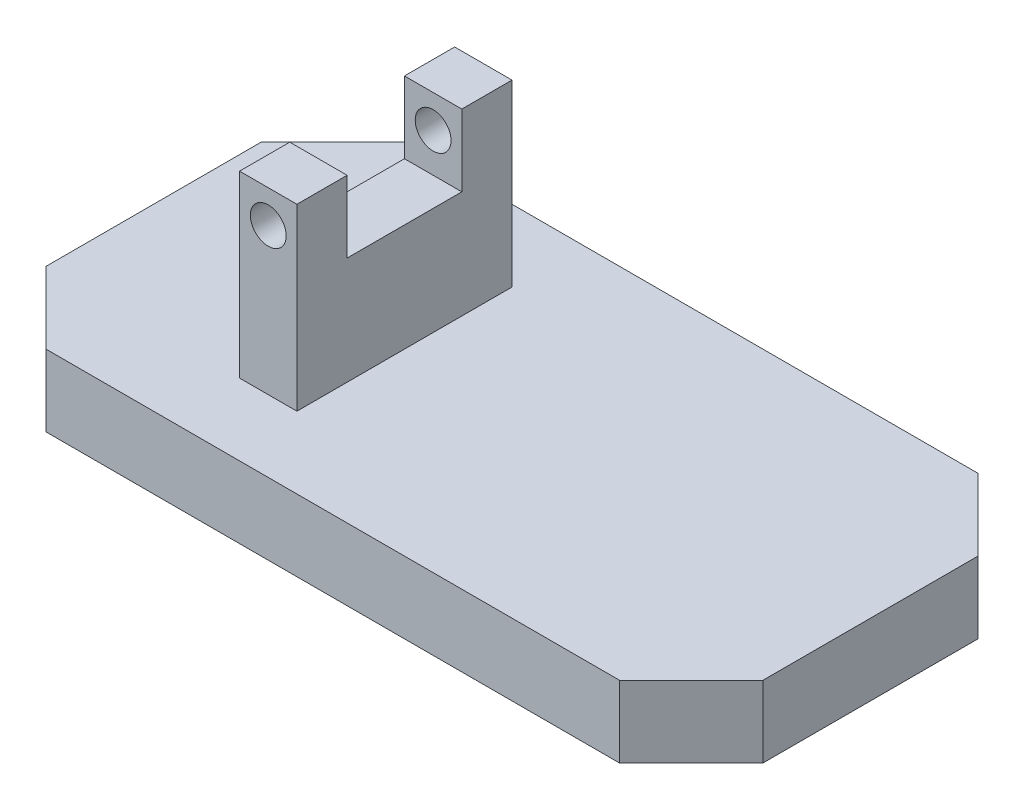
ISO-10303-21;
HEADER;
FILE_DESCRIPTION(('STEP AP214'),'2;1');
FILE_NAME('part.step','',(''),(''),'','','');
FILE_SCHEMA(('AUTOMOTIVE_DESIGN { 1 0 10303 214 1 1 1 1 }'));
ENDSEC;
DATA;
#1=APPLICATION_CONTEXT('core data for automotive mechanical design processes');
#2=APPLICATION_PROTOCOL_DEFINITION('international standard','automotive_design',2000,#1);
#3=PRODUCT_CONTEXT('',#1,'mechanical');
#4=PRODUCT('Part','Part','',(#3));
#5=PRODUCT_RELATED_PRODUCT_CATEGORY('part','',(#4));
#6=PRODUCT_DEFINITION_FORMATION('','',#4);
#7=PRODUCT_DEFINITION_CONTEXT('part definition',#1,'design');
#8=PRODUCT_DEFINITION('design','',#6,#7);
#9=PRODUCT_DEFINITION_SHAPE('','',#8);
#10=(LENGTH_UNIT() NAMED_UNIT(*) SI_UNIT(.MILLI.,.METRE.));
#11=(NAMED_UNIT(*) PLANE_ANGLE_UNIT() SI_UNIT($,.RADIAN.));
#12=(NAMED_UNIT(*) SI_UNIT($,.STERADIAN.) SOLID_ANGLE_UNIT());
#13=UNCERTAINTY_MEASURE_WITH_UNIT(LENGTH_MEASURE(1.E-05),#10,'distance_accuracy_value','');
#14=(GEOMETRIC_REPRESENTATION_CONTEXT(3) GLOBAL_UNCERTAINTY_ASSIGNED_CONTEXT((#13)) GLOBAL_UNIT_ASSIGNED_CONTEXT((#10,
#11,#12)) REPRESENTATION_CONTEXT('',''));
#15=CARTESIAN_POINT('',(0.,0.,0.));
#16=DIRECTION('',(0.,0.,1.));
#17=DIRECTION('',(1.,0.,0.));
#18=AXIS2_PLACEMENT_3D('',#15,#16,#17);
#19=CARTESIAN_POINT('',(0.,35.,0.));
#20=DIRECTION('',(0.,1.,0.));
#21=DIRECTION('',(0.,0.,1.));
#22=AXIS2_PLACEMENT_3D('',#19,#20,#21);
#23=PLANE('',#22);
#24=DIRECTION('',(-1.,0.,0.));
#25=VECTOR('',#24,1.);
#26=CARTESIAN_POINT('',(0.,35.,-8.));
#27=LINE('',#26,#25);
#28=CARTESIAN_POINT('',(-15.,35.,-8.));
#29=VERTEX_POINT('',#28);
#30=CARTESIAN_POINT('',(-23.,35.,-8.));
#31=VERTEX_POINT('',#30);
#32=EDGE_CURVE('E55',#29,#31,#27,.T.);
#33=ORIENTED_EDGE('',*,*,#32,.F.);
#34=DIRECTION('',(0.,0.,-1.));
#35=VECTOR('',#34,1.);
#36=CARTESIAN_POINT('',(-15.,35.,-15.));
#37=LINE('',#36,#35);
#38=CARTESIAN_POINT('',(-15.,35.,-15.));
#39=VERTEX_POINT('',#38);
#40=EDGE_CURVE('E183',#29,#39,#37,.T.);
#41=ORIENTED_EDGE('',*,*,#40,.T.);
#42=DIRECTION('',(-1.,0.,0.));
#43=VECTOR('',#42,1.);
#44=CARTESIAN_POINT('',(-23.,35.,-15.));
#45=LINE('',#44,#43);
#46=CARTESIAN_POINT('',(-23.,35.,-15.));
#47=VERTEX_POINT('',#46);
#48=EDGE_CURVE('E182',#39,#47,#45,.T.);
#49=ORIENTED_EDGE('',*,*,#48,.T.);
#50=DIRECTION('',(0.,0.,1.));
#51=VECTOR('',#50,1.);
#52=CARTESIAN_POINT('',(-23.,35.,-15.));
#53=LINE('',#52,#51);
#54=EDGE_CURVE('E281',#47,#31,#53,.T.);
#55=ORIENTED_EDGE('',*,*,#54,.T.);
#56=EDGE_LOOP('',(#33,#41,#49,#55));
#57=FACE_BOUND('',#56,.T.);
#58=ADVANCED_FACE('F45',(#57),#23,.T.);
#59=CARTESIAN_POINT('',(0.,10.,0.));
#60=DIRECTION('',(0.,1.,0.));
#61=DIRECTION('',(0.,0.,1.));
#62=AXIS2_PLACEMENT_3D('',#59,#60,#61);
#63=PLANE('',#62);
#64=DIRECTION('',(-1.,0.,0.));
#65=VECTOR('',#64,1.);
#66=CARTESIAN_POINT('',(-50.,10.,-25.));
#67=LINE('',#66,#65);
#68=CARTESIAN_POINT('',(40.,10.,-25.));
#69=VERTEX_POINT('',#68);
#70=CARTESIAN_POINT('',(-40.,10.,-25.));
#71=VERTEX_POINT('',#70);
#72=EDGE_CURVE('E219',#69,#71,#67,.T.);
#73=ORIENTED_EDGE('',*,*,#72,.T.);
#74=DIRECTION('',(0.707106781186549,0.,-0.707106781186547));
#75=VECTOR('',#74,1.);
#76=CARTESIAN_POINT('',(-32.4999999999999,10.,-32.5));
#77=LINE('',#76,#75);
#78=CARTESIAN_POINT('',(-50.,10.,-15.));
#79=VERTEX_POINT('',#78);
#80=EDGE_CURVE('E256',#71,#79,#77,.F.);
#81=ORIENTED_EDGE('',*,*,#80,.T.);
#82=DIRECTION('',(0.,0.,1.));
#83=VECTOR('',#82,1.);
#84=CARTESIAN_POINT('',(-50.,10.,-25.));
#85=LINE('',#84,#83);
#86=CARTESIAN_POINT('',(-50.,10.,15.));
#87=VERTEX_POINT('',#86);
#88=EDGE_CURVE('E209',#79,#87,#85,.T.);
#89=ORIENTED_EDGE('',*,*,#88,.T.);
#90=DIRECTION('',(-0.707106781186546,0.,-0.707106781186549));
#91=VECTOR('',#90,1.);
#92=CARTESIAN_POINT('',(-32.5000000000001,10.,32.5));
#93=LINE('',#92,#91);
#94=CARTESIAN_POINT('',(-40.,10.,25.));
#95=VERTEX_POINT('',#94);
#96=EDGE_CURVE('E254',#87,#95,#93,.F.);
#97=ORIENTED_EDGE('',*,*,#96,.T.);
#98=DIRECTION('',(1.,0.,0.));
#99=VECTOR('',#98,1.);
#100=CARTESIAN_POINT('',(-50.,10.,25.));
#101=LINE('',#100,#99);
#102=CARTESIAN_POINT('',(39.9999999999999,10.,25.));
#103=VERTEX_POINT('',#102);
#104=EDGE_CURVE('E212',#95,#103,#101,.T.);
#105=ORIENTED_EDGE('',*,*,#104,.T.);
#106=DIRECTION('',(-0.707106781186549,0.,0.707106781186546));
#107=VECTOR('',#106,1.);
#108=CARTESIAN_POINT('',(32.4999999999999,10.,32.5));
#109=LINE('',#108,#107);
#110=CARTESIAN_POINT('',(50.,10.,15.));
#111=VERTEX_POINT('',#110);
#112=EDGE_CURVE('E250',#103,#111,#109,.F.);
#113=ORIENTED_EDGE('',*,*,#112,.T.);
#114=DIRECTION('',(0.,0.,-1.));
#115=VECTOR('',#114,1.);
#116=CARTESIAN_POINT('',(50.,10.,-25.));
#117=LINE('',#116,#115);
#118=CARTESIAN_POINT('',(50.,10.,-15.));
#119=VERTEX_POINT('',#118);
#120=EDGE_CURVE('E216',#111,#119,#117,.T.);
#121=ORIENTED_EDGE('',*,*,#120,.T.);
#122=DIRECTION('',(0.707106781186547,0.,0.707106781186549));
#123=VECTOR('',#122,1.);
#124=CARTESIAN_POINT('',(32.5,10.,-32.5));
#125=LINE('',#124,#123);
#126=EDGE_CURVE('E252',#119,#69,#125,.F.);
#127=ORIENTED_EDGE('',*,*,#126,.T.);
#128=EDGE_LOOP('',(#73,#81,#89,#97,#105,#113,#121,#127));
#129=FACE_BOUND('',#128,.T.);
#130=DIRECTION('',(1.,0.,0.));
#131=VECTOR('',#130,1.);
#132=CARTESIAN_POINT('',(-23.,10.,15.));
#133=LINE('',#132,#131);
#134=CARTESIAN_POINT('',(-23.,10.,15.));
#135=VERTEX_POINT('',#134);
#136=CARTESIAN_POINT('',(-15.,10.,15.));
#137=VERTEX_POINT('',#136);
#138=EDGE_CURVE('E193',#135,#137,#133,.T.);
#139=ORIENTED_EDGE('',*,*,#138,.F.);
#140=DIRECTION('',(0.,0.,1.));
#141=VECTOR('',#140,1.);
#142=CARTESIAN_POINT('',(-23.,10.,-15.));
#143=LINE('',#142,#141);
#144=CARTESIAN_POINT('',(-23.,10.,-15.));
#145=VERTEX_POINT('',#144);
#146=EDGE_CURVE('E190',#145,#135,#143,.T.);
#147=ORIENTED_EDGE('',*,*,#146,.F.);
#148=DIRECTION('',(-1.,0.,0.));
#149=VECTOR('',#148,1.);
#150=CARTESIAN_POINT('',(-23.,10.,-15.));
#151=LINE('',#150,#149);
#152=CARTESIAN_POINT('',(-15.,10.,-15.));
#153=VERTEX_POINT('',#152);
#154=EDGE_CURVE('E198',#153,#145,#151,.T.);
#155=ORIENTED_EDGE('',*,*,#154,.F.);
#156=DIRECTION('',(0.,0.,-1.));
#157=VECTOR('',#156,1.);
#158=CARTESIAN_POINT('',(-15.,10.,-15.));
#159=LINE('',#158,#157);
#160=EDGE_CURVE('E196',#137,#153,#159,.T.);
#161=ORIENTED_EDGE('',*,*,#160,.F.);
#162=EDGE_LOOP('',(#139,#147,#155,#161));
#163=FACE_BOUND('',#162,.T.);
#164=ADVANCED_FACE('F317',(#129,#163),#63,.T.);
#165=CARTESIAN_POINT('',(-50.,10.,-25.));
#166=DIRECTION('',(1.,0.,0.));
#167=DIRECTION('',(0.,0.,-1.));
#168=AXIS2_PLACEMENT_3D('',#165,#166,#167);
#169=PLANE('',#168);
#170=ORIENTED_EDGE('',*,*,#88,.F.);
#171=DIRECTION('',(0.,-1.,0.));
#172=VECTOR('',#171,1.);
#173=CARTESIAN_POINT('',(-50.,10.,-15.));
#174=LINE('',#173,#172);
#175=CARTESIAN_POINT('',(-50.,0.,-15.));
#176=VERTEX_POINT('',#175);
#177=EDGE_CURVE('E234',#79,#176,#174,.T.);
#178=ORIENTED_EDGE('',*,*,#177,.T.);
#179=DIRECTION('',(0.,0.,1.));
#180=VECTOR('',#179,1.);
#181=CARTESIAN_POINT('',(-50.,0.,-25.));
#182=LINE('',#181,#180);
#183=CARTESIAN_POINT('',(-50.,0.,15.));
#184=VERTEX_POINT('',#183);
#185=EDGE_CURVE('E208',#176,#184,#182,.T.);
#186=ORIENTED_EDGE('',*,*,#185,.T.);
#187=DIRECTION('',(0.,1.,0.));
#188=VECTOR('',#187,1.);
#189=CARTESIAN_POINT('',(-50.,10.,15.));
#190=LINE('',#189,#188);
#191=EDGE_CURVE('E222',#184,#87,#190,.T.);
#192=ORIENTED_EDGE('',*,*,#191,.T.);
#193=EDGE_LOOP('',(#170,#178,#186,#192));
#194=FACE_BOUND('',#193,.T.);
#195=ADVANCED_FACE('F323',(#194),#169,.F.);
#196=CARTESIAN_POINT('',(-50.,10.,25.));
#197=DIRECTION('',(0.,0.,-1.));
#198=DIRECTION('',(-1.,0.,0.));
#199=AXIS2_PLACEMENT_3D('',#196,#197,#198);
#200=PLANE('',#199);
#201=ORIENTED_EDGE('',*,*,#104,.F.);
#202=DIRECTION('',(0.,-1.,0.));
#203=VECTOR('',#202,1.);
#204=CARTESIAN_POINT('',(-40.,10.,25.));
#205=LINE('',#204,#203);
#206=CARTESIAN_POINT('',(-40.,0.,25.));
#207=VERTEX_POINT('',#206);
#208=EDGE_CURVE('E260',#95,#207,#205,.T.);
#209=ORIENTED_EDGE('',*,*,#208,.T.);
#210=DIRECTION('',(1.,0.,0.));
#211=VECTOR('',#210,1.);
#212=CARTESIAN_POINT('',(-50.,0.,25.));
#213=LINE('',#212,#211);
#214=CARTESIAN_POINT('',(39.9999999999999,0.,25.));
#215=VERTEX_POINT('',#214);
#216=EDGE_CURVE('E225',#207,#215,#213,.T.);
#217=ORIENTED_EDGE('',*,*,#216,.T.);
#218=DIRECTION('',(0.,1.,0.));
#219=VECTOR('',#218,1.);
#220=CARTESIAN_POINT('',(39.9999999999999,10.,25.));
#221=LINE('',#220,#219);
#222=EDGE_CURVE('E258',#215,#103,#221,.T.);
#223=ORIENTED_EDGE('',*,*,#222,.T.);
#224=EDGE_LOOP('',(#201,#209,#217,#223));
#225=FACE_BOUND('',#224,.T.);
#226=ADVANCED_FACE('F359',(#225),#200,.F.);
#227=CARTESIAN_POINT('',(50.,10.,-25.));
#228=DIRECTION('',(-1.,0.,0.));
#229=DIRECTION('',(0.,0.,1.));
#230=AXIS2_PLACEMENT_3D('',#227,#228,#229);
#231=PLANE('',#230);
#232=DIRECTION('',(0.,0.,-1.));
#233=VECTOR('',#232,1.);
#234=CARTESIAN_POINT('',(50.,0.,-25.));
#235=LINE('',#234,#233);
#236=CARTESIAN_POINT('',(50.,0.,15.));
#237=VERTEX_POINT('',#236);
#238=CARTESIAN_POINT('',(50.,0.,-15.));
#239=VERTEX_POINT('',#238);
#240=EDGE_CURVE('E228',#237,#239,#235,.T.);
#241=ORIENTED_EDGE('',*,*,#240,.T.);
#242=DIRECTION('',(0.,1.,0.));
#243=VECTOR('',#242,1.);
#244=CARTESIAN_POINT('',(50.,10.,-15.));
#245=LINE('',#244,#243);
#246=EDGE_CURVE('E166',#239,#119,#245,.T.);
#247=ORIENTED_EDGE('',*,*,#246,.T.);
#248=ORIENTED_EDGE('',*,*,#120,.F.);
#249=DIRECTION('',(0.,-1.,0.));
#250=VECTOR('',#249,1.);
#251=CARTESIAN_POINT('',(50.,10.,15.));
#252=LINE('',#251,#250);
#253=EDGE_CURVE('E263',#111,#237,#252,.T.);
#254=ORIENTED_EDGE('',*,*,#253,.T.);
#255=EDGE_LOOP('',(#241,#247,#248,#254));
#256=FACE_BOUND('',#255,.T.);
#257=ADVANCED_FACE('F355',(#256),#231,.F.);
#258=CARTESIAN_POINT('',(-50.,10.,-25.));
#259=DIRECTION('',(0.,0.,1.));
#260=DIRECTION('',(1.,0.,0.));
#261=AXIS2_PLACEMENT_3D('',#258,#259,#260);
#262=PLANE('',#261);
#263=DIRECTION('',(-1.,0.,0.));
#264=VECTOR('',#263,1.);
#265=CARTESIAN_POINT('',(-50.,0.,-25.));
#266=LINE('',#265,#264);
#267=CARTESIAN_POINT('',(40.,0.,-25.));
#268=VERTEX_POINT('',#267);
#269=CARTESIAN_POINT('',(-40.,0.,-25.));
#270=VERTEX_POINT('',#269);
#271=EDGE_CURVE('E213',#268,#270,#266,.T.);
#272=ORIENTED_EDGE('',*,*,#271,.T.);
#273=DIRECTION('',(0.,1.,0.));
#274=VECTOR('',#273,1.);
#275=CARTESIAN_POINT('',(-40.,10.,-25.));
#276=LINE('',#275,#274);
#277=EDGE_CURVE('E248',#270,#71,#276,.T.);
#278=ORIENTED_EDGE('',*,*,#277,.T.);
#279=ORIENTED_EDGE('',*,*,#72,.F.);
#280=DIRECTION('',(0.,-1.,0.));
#281=VECTOR('',#280,1.);
#282=CARTESIAN_POINT('',(40.,10.,-25.));
#283=LINE('',#282,#281);
#284=EDGE_CURVE('E245',#69,#268,#283,.T.);
#285=ORIENTED_EDGE('',*,*,#284,.T.);
#286=EDGE_LOOP('',(#272,#278,#279,#285));
#287=FACE_BOUND('',#286,.T.);
#288=ADVANCED_FACE('F351',(#287),#262,.F.);
#289=CARTESIAN_POINT('',(0.,0.,0.));
#290=DIRECTION('',(0.,1.,0.));
#291=DIRECTION('',(0.,0.,1.));
#292=AXIS2_PLACEMENT_3D('',#289,#290,#291);
#293=PLANE('',#292);
#294=ORIENTED_EDGE('',*,*,#185,.F.);
#295=DIRECTION('',(-0.707106781186549,0.,0.707106781186547));
#296=VECTOR('',#295,1.);
#297=CARTESIAN_POINT('',(-50.,0.,-15.));
#298=LINE('',#297,#296);
#299=EDGE_CURVE('E243',#176,#270,#298,.F.);
#300=ORIENTED_EDGE('',*,*,#299,.T.);
#301=ORIENTED_EDGE('',*,*,#271,.F.);
#302=DIRECTION('',(-0.707106781186547,0.,-0.707106781186549));
#303=VECTOR('',#302,1.);
#304=CARTESIAN_POINT('',(40.,0.,-25.));
#305=LINE('',#304,#303);
#306=EDGE_CURVE('E239',#268,#239,#305,.F.);
#307=ORIENTED_EDGE('',*,*,#306,.T.);
#308=ORIENTED_EDGE('',*,*,#240,.F.);
#309=DIRECTION('',(0.707106781186549,0.,-0.707106781186546));
#310=VECTOR('',#309,1.);
#311=CARTESIAN_POINT('',(50.,0.,15.));
#312=LINE('',#311,#310);
#313=EDGE_CURVE('E237',#237,#215,#312,.F.);
#314=ORIENTED_EDGE('',*,*,#313,.T.);
#315=ORIENTED_EDGE('',*,*,#216,.F.);
#316=DIRECTION('',(0.707106781186546,0.,0.707106781186549));
#317=VECTOR('',#316,1.);
#318=CARTESIAN_POINT('',(-40.,0.,25.));
#319=LINE('',#318,#317);
#320=EDGE_CURVE('E241',#207,#184,#319,.F.);
#321=ORIENTED_EDGE('',*,*,#320,.T.);
#322=EDGE_LOOP('',(#294,#300,#301,#307,#308,#314,#315,#321));
#323=FACE_BOUND('',#322,.T.);
#324=ADVANCED_FACE('F347',(#323),#293,.F.);
#325=CARTESIAN_POINT('',(-50.,10.,-15.));
#326=DIRECTION('',(0.707106781186547,0.,0.707106781186549));
#327=DIRECTION('',(0.,-1.,0.));
#328=AXIS2_PLACEMENT_3D('',#325,#326,#327);
#329=PLANE('',#328);
#330=ORIENTED_EDGE('',*,*,#80,.F.);
#331=ORIENTED_EDGE('',*,*,#277,.F.);
#332=ORIENTED_EDGE('',*,*,#299,.F.);
#333=ORIENTED_EDGE('',*,*,#177,.F.);
#334=EDGE_LOOP('',(#330,#331,#332,#333));
#335=FACE_BOUND('',#334,.T.);
#336=ADVANCED_FACE('F350',(#335),#329,.F.);
#337=CARTESIAN_POINT('',(-40.,10.,25.));
#338=DIRECTION('',(0.707106781186549,0.,-0.707106781186546));
#339=DIRECTION('',(0.,-1.,0.));
#340=AXIS2_PLACEMENT_3D('',#337,#338,#339);
#341=PLANE('',#340);
#342=ORIENTED_EDGE('',*,*,#96,.F.);
#343=ORIENTED_EDGE('',*,*,#191,.F.);
#344=ORIENTED_EDGE('',*,*,#320,.F.);
#345=ORIENTED_EDGE('',*,*,#208,.F.);
#346=EDGE_LOOP('',(#342,#343,#344,#345));
#347=FACE_BOUND('',#346,.T.);
#348=ADVANCED_FACE('F373',(#347),#341,.F.);
#349=CARTESIAN_POINT('',(40.,10.,-25.));
#350=DIRECTION('',(-0.707106781186549,0.,0.707106781186547));
#351=DIRECTION('',(0.,-1.,0.));
#352=AXIS2_PLACEMENT_3D('',#349,#350,#351);
#353=PLANE('',#352);
#354=ORIENTED_EDGE('',*,*,#126,.F.);
#355=ORIENTED_EDGE('',*,*,#246,.F.);
#356=ORIENTED_EDGE('',*,*,#306,.F.);
#357=ORIENTED_EDGE('',*,*,#284,.F.);
#358=EDGE_LOOP('',(#354,#355,#356,#357));
#359=FACE_BOUND('',#358,.T.);
#360=ADVANCED_FACE('F379',(#359),#353,.F.);
#361=CARTESIAN_POINT('',(50.,10.,15.));
#362=DIRECTION('',(-0.707106781186546,0.,-0.707106781186549));
#363=DIRECTION('',(0.,-1.,0.));
#364=AXIS2_PLACEMENT_3D('',#361,#362,#363);
#365=PLANE('',#364);
#366=ORIENTED_EDGE('',*,*,#112,.F.);
#367=ORIENTED_EDGE('',*,*,#222,.F.);
#368=ORIENTED_EDGE('',*,*,#313,.F.);
#369=ORIENTED_EDGE('',*,*,#253,.F.);
#370=EDGE_LOOP('',(#366,#367,#368,#369));
#371=FACE_BOUND('',#370,.T.);
#372=ADVANCED_FACE('F48',(#371),#365,.F.);
#373=CARTESIAN_POINT('',(-23.,35.,-15.));
#374=DIRECTION('',(1.,0.,0.));
#375=DIRECTION('',(0.,0.,-1.));
#376=AXIS2_PLACEMENT_3D('',#373,#374,#375);
#377=PLANE('',#376);
#378=DIRECTION('',(0.,0.,1.));
#379=VECTOR('',#378,1.);
#380=CARTESIAN_POINT('',(-23.,25.,-15.));
#381=LINE('',#380,#379);
#382=CARTESIAN_POINT('',(-23.,25.,-8.));
#383=VERTEX_POINT('',#382);
#384=CARTESIAN_POINT('',(-23.,25.,8.));
#385=VERTEX_POINT('',#384);
#386=EDGE_CURVE('E194',#383,#385,#381,.T.);
#387=ORIENTED_EDGE('',*,*,#386,.F.);
#388=DIRECTION('',(0.,1.,0.));
#389=VECTOR('',#388,1.);
#390=CARTESIAN_POINT('',(-23.,35.,-8.));
#391=LINE('',#390,#389);
#392=EDGE_CURVE('E272',#383,#31,#391,.T.);
#393=ORIENTED_EDGE('',*,*,#392,.T.);
#394=ORIENTED_EDGE('',*,*,#54,.F.);
#395=DIRECTION('',(0.,-1.,0.));
#396=VECTOR('',#395,1.);
#397=CARTESIAN_POINT('',(-23.,35.,-15.));
#398=LINE('',#397,#396);
#399=EDGE_CURVE('E185',#47,#145,#398,.T.);
#400=ORIENTED_EDGE('',*,*,#399,.T.);
#401=ORIENTED_EDGE('',*,*,#146,.T.);
#402=DIRECTION('',(0.,-1.,0.));
#403=VECTOR('',#402,1.);
#404=CARTESIAN_POINT('',(-23.,35.,15.));
#405=LINE('',#404,#403);
#406=CARTESIAN_POINT('',(-23.,35.,15.));
#407=VERTEX_POINT('',#406);
#408=EDGE_CURVE('E206',#407,#135,#405,.T.);
#409=ORIENTED_EDGE('',*,*,#408,.F.);
#410=CARTESIAN_POINT('',(-23.,35.,8.));
#411=VERTEX_POINT('',#410);
#412=EDGE_CURVE('E200',#411,#407,#53,.T.);
#413=ORIENTED_EDGE('',*,*,#412,.F.);
#414=DIRECTION('',(0.,-1.,0.));
#415=VECTOR('',#414,1.);
#416=CARTESIAN_POINT('',(-23.,35.,8.));
#417=LINE('',#416,#415);
#418=EDGE_CURVE('E62',#411,#385,#417,.T.);
#419=ORIENTED_EDGE('',*,*,#418,.T.);
#420=EDGE_LOOP('',(#387,#393,#394,#400,#401,#409,#413,#419));
#421=FACE_BOUND('',#420,.T.);
#422=ADVANCED_FACE('F280',(#421),#377,.F.);
#423=CARTESIAN_POINT('',(-23.,35.,15.));
#424=DIRECTION('',(0.,0.,-1.));
#425=DIRECTION('',(-1.,0.,0.));
#426=AXIS2_PLACEMENT_3D('',#423,#424,#425);
#427=PLANE('',#426);
#428=CARTESIAN_POINT('',(-19.,30.4286384577808,15.));
#429=DIRECTION('',(0.,0.,1.));
#430=DIRECTION('',(1.,0.,0.));
#431=AXIS2_PLACEMENT_3D('',#428,#429,#430);
#432=CIRCLE('',#431,2.5);
#433=CARTESIAN_POINT('',(-16.5,30.4286384577808,15.));
#434=VERTEX_POINT('',#433);
#435=EDGE_CURVE('E297',#434,#434,#432,.T.);
#436=ORIENTED_EDGE('',*,*,#435,.F.);
#437=EDGE_LOOP('',(#436));
#438=FACE_BOUND('',#437,.T.);
#439=ORIENTED_EDGE('',*,*,#138,.T.);
#440=DIRECTION('',(0.,-1.,0.));
#441=VECTOR('',#440,1.);
#442=CARTESIAN_POINT('',(-15.,35.,15.));
#443=LINE('',#442,#441);
#444=CARTESIAN_POINT('',(-15.,35.,15.));
#445=VERTEX_POINT('',#444);
#446=EDGE_CURVE('E204',#445,#137,#443,.T.);
#447=ORIENTED_EDGE('',*,*,#446,.F.);
#448=DIRECTION('',(1.,0.,0.));
#449=VECTOR('',#448,1.);
#450=CARTESIAN_POINT('',(-23.,35.,15.));
#451=LINE('',#450,#449);
#452=EDGE_CURVE('E180',#407,#445,#451,.T.);
#453=ORIENTED_EDGE('',*,*,#452,.F.);
#454=ORIENTED_EDGE('',*,*,#408,.T.);
#455=EDGE_LOOP('',(#439,#447,#453,#454));
#456=FACE_BOUND('',#455,.T.);
#457=ADVANCED_FACE('F341',(#438,#456),#427,.F.);
#458=CARTESIAN_POINT('',(-15.,35.,-15.));
#459=DIRECTION('',(-1.,0.,0.));
#460=DIRECTION('',(0.,0.,1.));
#461=AXIS2_PLACEMENT_3D('',#458,#459,#460);
#462=PLANE('',#461);
#463=ORIENTED_EDGE('',*,*,#40,.F.);
#464=DIRECTION('',(0.,-1.,0.));
#465=VECTOR('',#464,1.);
#466=CARTESIAN_POINT('',(-15.,35.,-8.));
#467=LINE('',#466,#465);
#468=CARTESIAN_POINT('',(-15.,25.,-8.));
#469=VERTEX_POINT('',#468);
#470=EDGE_CURVE('E274',#29,#469,#467,.T.);
#471=ORIENTED_EDGE('',*,*,#470,.T.);
#472=DIRECTION('',(0.,0.,-1.));
#473=VECTOR('',#472,1.);
#474=CARTESIAN_POINT('',(-15.,25.,-15.));
#475=LINE('',#474,#473);
#476=CARTESIAN_POINT('',(-15.,25.,8.));
#477=VERTEX_POINT('',#476);
#478=EDGE_CURVE('E11',#477,#469,#475,.T.);
#479=ORIENTED_EDGE('',*,*,#478,.F.);
#480=DIRECTION('',(0.,1.,0.));
#481=VECTOR('',#480,1.);
#482=CARTESIAN_POINT('',(-15.,35.,8.));
#483=LINE('',#482,#481);
#484=CARTESIAN_POINT('',(-15.,35.,8.));
#485=VERTEX_POINT('',#484);
#486=EDGE_CURVE('E161',#477,#485,#483,.T.);
#487=ORIENTED_EDGE('',*,*,#486,.T.);
#488=EDGE_CURVE('E174',#445,#485,#37,.T.);
#489=ORIENTED_EDGE('',*,*,#488,.F.);
#490=ORIENTED_EDGE('',*,*,#446,.T.);
#491=ORIENTED_EDGE('',*,*,#160,.T.);
#492=DIRECTION('',(0.,-1.,0.));
#493=VECTOR('',#492,1.);
#494=CARTESIAN_POINT('',(-15.,35.,-15.));
#495=LINE('',#494,#493);
#496=EDGE_CURVE('E70',#39,#153,#495,.T.);
#497=ORIENTED_EDGE('',*,*,#496,.F.);
#498=EDGE_LOOP('',(#463,#471,#479,#487,#489,#490,#491,#497));
#499=FACE_BOUND('',#498,.T.);
#500=ADVANCED_FACE('F172',(#499),#462,.F.);
#501=CARTESIAN_POINT('',(-23.,35.,-15.));
#502=DIRECTION('',(0.,0.,1.));
#503=DIRECTION('',(1.,0.,0.));
#504=AXIS2_PLACEMENT_3D('',#501,#502,#503);
#505=PLANE('',#504);
#506=CARTESIAN_POINT('',(-19.,30.4286384577808,-15.));
#507=DIRECTION('',(0.,0.,1.));
#508=DIRECTION('',(1.,0.,0.));
#509=AXIS2_PLACEMENT_3D('',#506,#507,#508);
#510=CIRCLE('',#509,2.5);
#511=CARTESIAN_POINT('',(-16.5,30.4286384577808,-15.));
#512=VERTEX_POINT('',#511);
#513=EDGE_CURVE('E291',#512,#512,#510,.T.);
#514=ORIENTED_EDGE('',*,*,#513,.T.);
#515=EDGE_LOOP('',(#514));
#516=FACE_BOUND('',#515,.T.);
#517=ORIENTED_EDGE('',*,*,#154,.T.);
#518=ORIENTED_EDGE('',*,*,#399,.F.);
#519=ORIENTED_EDGE('',*,*,#48,.F.);
#520=ORIENTED_EDGE('',*,*,#496,.T.);
#521=EDGE_LOOP('',(#517,#518,#519,#520));
#522=FACE_BOUND('',#521,.T.);
#523=ADVANCED_FACE('F329',(#516,#522),#505,.F.);
#524=DIRECTION('',(1.,0.,0.));
#525=VECTOR('',#524,1.);
#526=CARTESIAN_POINT('',(0.,35.,8.));
#527=LINE('',#526,#525);
#528=EDGE_CURVE('E158',#411,#485,#527,.T.);
#529=ORIENTED_EDGE('',*,*,#528,.F.);
#530=ORIENTED_EDGE('',*,*,#412,.T.);
#531=ORIENTED_EDGE('',*,*,#452,.T.);
#532=ORIENTED_EDGE('',*,*,#488,.T.);
#533=EDGE_LOOP('',(#529,#530,#531,#532));
#534=FACE_BOUND('',#533,.T.);
#535=ADVANCED_FACE('F178',(#534),#23,.T.);
#536=CARTESIAN_POINT('',(0.,25.,0.));
#537=DIRECTION('',(0.,1.,0.));
#538=DIRECTION('',(0.,0.,1.));
#539=AXIS2_PLACEMENT_3D('',#536,#537,#538);
#540=PLANE('',#539);
#541=ORIENTED_EDGE('',*,*,#386,.T.);
#542=DIRECTION('',(1.,0.,0.));
#543=VECTOR('',#542,1.);
#544=CARTESIAN_POINT('',(-30.2480348481143,25.,8.));
#545=LINE('',#544,#543);
#546=EDGE_CURVE('E289',#385,#477,#545,.T.);
#547=ORIENTED_EDGE('',*,*,#546,.T.);
#548=ORIENTED_EDGE('',*,*,#478,.T.);
#549=DIRECTION('',(-1.,0.,0.));
#550=VECTOR('',#549,1.);
#551=CARTESIAN_POINT('',(-30.2480348481143,25.,-8.));
#552=LINE('',#551,#550);
#553=EDGE_CURVE('E176',#469,#383,#552,.T.);
#554=ORIENTED_EDGE('',*,*,#553,.T.);
#555=EDGE_LOOP('',(#541,#547,#548,#554));
#556=FACE_BOUND('',#555,.T.);
#557=ADVANCED_FACE('F328',(#556),#540,.T.);
#558=CARTESIAN_POINT('',(-30.2480348481143,25.,-8.));
#559=DIRECTION('',(0.,0.,-1.));
#560=DIRECTION('',(-1.,0.,0.));
#561=AXIS2_PLACEMENT_3D('',#558,#559,#560);
#562=PLANE('',#561);
#563=CARTESIAN_POINT('',(-19.,30.4286384577808,-8.));
#564=DIRECTION('',(0.,0.,-1.));
#565=DIRECTION('',(-1.,0.,0.));
#566=AXIS2_PLACEMENT_3D('',#563,#564,#565);
#567=CIRCLE('',#566,2.5);
#568=CARTESIAN_POINT('',(-21.5,30.4286384577808,-8.));
#569=VERTEX_POINT('',#568);
#570=EDGE_CURVE('E294',#569,#569,#567,.T.);
#571=ORIENTED_EDGE('',*,*,#570,.T.);
#572=EDGE_LOOP('',(#571));
#573=FACE_BOUND('',#572,.T.);
#574=ORIENTED_EDGE('',*,*,#553,.F.);
#575=ORIENTED_EDGE('',*,*,#470,.F.);
#576=ORIENTED_EDGE('',*,*,#32,.T.);
#577=ORIENTED_EDGE('',*,*,#392,.F.);
#578=EDGE_LOOP('',(#574,#575,#576,#577));
#579=FACE_BOUND('',#578,.T.);
#580=ADVANCED_FACE('F271',(#573,#579),#562,.F.);
#581=CARTESIAN_POINT('',(-30.2480348481143,25.,8.));
#582=DIRECTION('',(0.,0.,1.));
#583=DIRECTION('',(1.,0.,0.));
#584=AXIS2_PLACEMENT_3D('',#581,#582,#583);
#585=PLANE('',#584);
#586=CARTESIAN_POINT('',(-19.,30.4286384577808,8.));
#587=DIRECTION('',(0.,0.,1.));
#588=DIRECTION('',(1.,0.,0.));
#589=AXIS2_PLACEMENT_3D('',#586,#587,#588);
#590=CIRCLE('',#589,2.5);
#591=CARTESIAN_POINT('',(-16.5,30.4286384577808,8.));
#592=VERTEX_POINT('',#591);
#593=EDGE_CURVE('E50',#592,#592,#590,.T.);
#594=ORIENTED_EDGE('',*,*,#593,.T.);
#595=EDGE_LOOP('',(#594));
#596=FACE_BOUND('',#595,.T.);
#597=ORIENTED_EDGE('',*,*,#528,.T.);
#598=ORIENTED_EDGE('',*,*,#486,.F.);
#599=ORIENTED_EDGE('',*,*,#546,.F.);
#600=ORIENTED_EDGE('',*,*,#418,.F.);
#601=EDGE_LOOP('',(#597,#598,#599,#600));
#602=FACE_BOUND('',#601,.T.);
#603=ADVANCED_FACE('F160',(#596,#602),#585,.F.);
#604=CARTESIAN_POINT('',(-19.,30.4286384577808,-27.));
#605=DIRECTION('',(0.,0.,1.));
#606=DIRECTION('',(1.,0.,0.));
#607=AXIS2_PLACEMENT_3D('',#604,#605,#606);
#608=CYLINDRICAL_SURFACE('',#607,2.5);
#609=ORIENTED_EDGE('',*,*,#435,.T.);
#610=EDGE_LOOP('',(#609));
#611=FACE_BOUND('',#610,.T.);
#612=ORIENTED_EDGE('',*,*,#593,.F.);
#613=EDGE_LOOP('',(#612));
#614=FACE_BOUND('',#613,.T.);
#615=ADVANCED_FACE('F305',(#611,#614),#608,.F.);
#616=ORIENTED_EDGE('',*,*,#570,.F.);
#617=EDGE_LOOP('',(#616));
#618=FACE_BOUND('',#617,.T.);
#619=ORIENTED_EDGE('',*,*,#513,.F.);
#620=EDGE_LOOP('',(#619));
#621=FACE_BOUND('',#620,.T.);
#622=ADVANCED_FACE('F307',(#618,#621),#608,.F.);
#623=CLOSED_SHELL('',(#58,#164,#195,#226,#257,#288,#324,#336,#348,#360,#372,#422,#457,#500,#523,
#535,#557,#580,#603,#615,#622));
#624=MANIFOLD_SOLID_BREP('B2',#623);
#625=ADVANCED_BREP_SHAPE_REPRESENTATION('',(#18,#624),#14);
#626=SHAPE_DEFINITION_REPRESENTATION(#9,#625);
ENDSEC;
END-ISO-10303-21;
